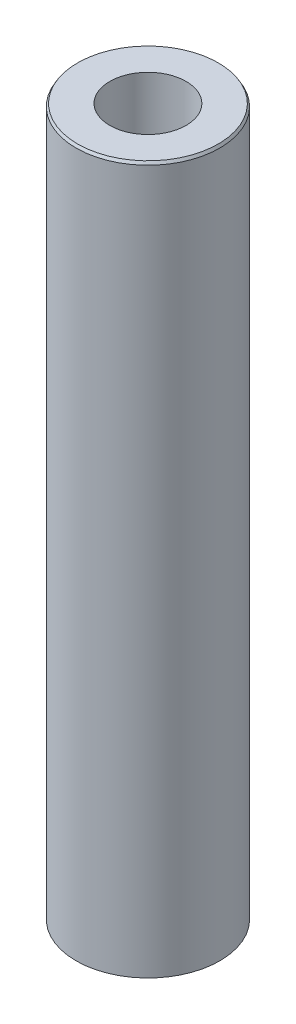
ISO-10303-21;
HEADER;
FILE_DESCRIPTION(('STEP AP214'),'2;1');
FILE_NAME('part.step','',(''),(''),'','','');
FILE_SCHEMA(('AUTOMOTIVE_DESIGN { 1 0 10303 214 1 1 1 1 }'));
ENDSEC;
DATA;
#1=APPLICATION_CONTEXT('core data for automotive mechanical design processes');
#2=APPLICATION_PROTOCOL_DEFINITION('international standard','automotive_design',2000,#1);
#3=PRODUCT_CONTEXT('',#1,'mechanical');
#4=PRODUCT('Part','Part','',(#3));
#5=PRODUCT_RELATED_PRODUCT_CATEGORY('part','',(#4));
#6=PRODUCT_DEFINITION_FORMATION('','',#4);
#7=PRODUCT_DEFINITION_CONTEXT('part definition',#1,'design');
#8=PRODUCT_DEFINITION('design','',#6,#7);
#9=PRODUCT_DEFINITION_SHAPE('','',#8);
#10=(LENGTH_UNIT() NAMED_UNIT(*) SI_UNIT(.MILLI.,.METRE.));
#11=(NAMED_UNIT(*) PLANE_ANGLE_UNIT() SI_UNIT($,.RADIAN.));
#12=(NAMED_UNIT(*) SI_UNIT($,.STERADIAN.) SOLID_ANGLE_UNIT());
#13=UNCERTAINTY_MEASURE_WITH_UNIT(LENGTH_MEASURE(1.E-05),#10,'distance_accuracy_value','');
#14=(GEOMETRIC_REPRESENTATION_CONTEXT(3) GLOBAL_UNCERTAINTY_ASSIGNED_CONTEXT((#13)) GLOBAL_UNIT_ASSIGNED_CONTEXT((#10,
#11,#12)) REPRESENTATION_CONTEXT('',''));
#15=CARTESIAN_POINT('',(0.,0.,0.));
#16=DIRECTION('',(0.,0.,1.));
#17=DIRECTION('',(1.,0.,0.));
#18=AXIS2_PLACEMENT_3D('',#15,#16,#17);
#19=CARTESIAN_POINT('',(0.,467.889511771719,0.));
#20=DIRECTION('',(0.,-1.,0.));
#21=DIRECTION('',(0.,0.,-1.));
#22=AXIS2_PLACEMENT_3D('',#19,#20,#21);
#23=CYLINDRICAL_SURFACE('',#22,47.5);
#24=CARTESIAN_POINT('',(0.,466.091260623015,0.));
#25=DIRECTION('',(0.,1.,0.));
#26=DIRECTION('',(0.,0.,1.));
#27=AXIS2_PLACEMENT_3D('',#24,#25,#26);
#28=CIRCLE('',#27,47.5);
#29=CARTESIAN_POINT('',(0.,466.091260623015,47.5));
#30=VERTEX_POINT('',#29);
#31=EDGE_CURVE('E50',#30,#30,#28,.F.);
#32=ORIENTED_EDGE('',*,*,#31,.T.);
#33=EDGE_LOOP('',(#32));
#34=FACE_BOUND('',#33,.T.);
#35=CARTESIAN_POINT('',(0.,1.03822078477483,0.));
#36=DIRECTION('',(0.,1.,0.));
#37=DIRECTION('',(0.,0.,1.));
#38=AXIS2_PLACEMENT_3D('',#35,#36,#37);
#39=CIRCLE('',#38,47.5);
#40=CARTESIAN_POINT('',(0.,1.03822078477483,47.5));
#41=VERTEX_POINT('',#40);
#42=EDGE_CURVE('E51',#41,#41,#39,.T.);
#43=ORIENTED_EDGE('',*,*,#42,.T.);
#44=EDGE_LOOP('',(#43));
#45=FACE_BOUND('',#44,.T.);
#46=ADVANCED_FACE('F39',(#34,#45),#23,.T.);
#47=CARTESIAN_POINT('',(0.,467.889511771719,0.));
#48=DIRECTION('',(0.,1.,0.));
#49=DIRECTION('',(0.,0.,1.));
#50=AXIS2_PLACEMENT_3D('',#47,#48,#49);
#51=PLANE('',#50);
#52=CARTESIAN_POINT('',(0.,467.889511771719,0.));
#53=DIRECTION('',(0.,1.,0.));
#54=DIRECTION('',(0.,0.,1.));
#55=AXIS2_PLACEMENT_3D('',#52,#53,#54);
#56=CIRCLE('',#55,46.4617792152253);
#57=CARTESIAN_POINT('',(0.,467.889511771719,46.4617792152253));
#58=VERTEX_POINT('',#57);
#59=EDGE_CURVE('E54',#58,#58,#56,.T.);
#60=ORIENTED_EDGE('',*,*,#59,.T.);
#61=EDGE_LOOP('',(#60));
#62=FACE_BOUND('',#61,.T.);
#63=CARTESIAN_POINT('',(0.,467.889511771719,0.));
#64=DIRECTION('',(0.,1.,0.));
#65=DIRECTION('',(0.,0.,1.));
#66=AXIS2_PLACEMENT_3D('',#63,#64,#65);
#67=CIRCLE('',#66,25.2132302449308);
#68=CARTESIAN_POINT('',(0.,467.889511771719,25.2132302449308));
#69=VERTEX_POINT('',#68);
#70=EDGE_CURVE('E58',#69,#69,#67,.T.);
#71=ORIENTED_EDGE('',*,*,#70,.F.);
#72=EDGE_LOOP('',(#71));
#73=FACE_BOUND('',#72,.T.);
#74=ADVANCED_FACE('F69',(#62,#73),#51,.T.);
#75=CARTESIAN_POINT('',(0.,0.,0.));
#76=DIRECTION('',(0.,1.,0.));
#77=DIRECTION('',(0.,0.,1.));
#78=AXIS2_PLACEMENT_3D('',#75,#76,#77);
#79=PLANE('',#78);
#80=CARTESIAN_POINT('',(0.,0.,0.));
#81=DIRECTION('',(0.,1.,0.));
#82=DIRECTION('',(0.,0.,1.));
#83=AXIS2_PLACEMENT_3D('',#80,#81,#82);
#84=CIRCLE('',#83,45.701748851296);
#85=CARTESIAN_POINT('',(0.,0.,45.701748851296));
#86=VERTEX_POINT('',#85);
#87=EDGE_CURVE('E10',#86,#86,#84,.F.);
#88=ORIENTED_EDGE('',*,*,#87,.T.);
#89=EDGE_LOOP('',(#88));
#90=FACE_BOUND('',#89,.T.);
#91=CARTESIAN_POINT('',(0.,0.,0.));
#92=DIRECTION('',(0.,1.,0.));
#93=DIRECTION('',(0.,0.,1.));
#94=AXIS2_PLACEMENT_3D('',#91,#92,#93);
#95=CIRCLE('',#94,25.2132302449308);
#96=CARTESIAN_POINT('',(0.,0.,25.2132302449308));
#97=VERTEX_POINT('',#96);
#98=EDGE_CURVE('E63',#97,#97,#95,.T.);
#99=ORIENTED_EDGE('',*,*,#98,.T.);
#100=EDGE_LOOP('',(#99));
#101=FACE_BOUND('',#100,.T.);
#102=ADVANCED_FACE('F75',(#90,#101),#79,.F.);
#103=CARTESIAN_POINT('',(0.,467.889511771719,0.));
#104=DIRECTION('',(0.,-1.,0.));
#105=DIRECTION('',(0.,0.,-1.));
#106=AXIS2_PLACEMENT_3D('',#103,#104,#105);
#107=CYLINDRICAL_SURFACE('',#106,25.2132302449308);
#108=ORIENTED_EDGE('',*,*,#70,.T.);
#109=EDGE_LOOP('',(#108));
#110=FACE_BOUND('',#109,.T.);
#111=ORIENTED_EDGE('',*,*,#98,.F.);
#112=EDGE_LOOP('',(#111));
#113=FACE_BOUND('',#112,.T.);
#114=ADVANCED_FACE('F70',(#110,#113),#107,.F.);
#115=CARTESIAN_POINT('',(0.,467.889511771719,0.));
#116=DIRECTION('',(0.,-1.,0.));
#117=DIRECTION('',(0.,0.,-1.));
#118=AXIS2_PLACEMENT_3D('',#115,#116,#117);
#119=CONICAL_SURFACE('',#118,46.4617792152253,0.523598775598299);
#120=ORIENTED_EDGE('',*,*,#31,.F.);
#121=EDGE_LOOP('',(#120));
#122=FACE_BOUND('',#121,.T.);
#123=ORIENTED_EDGE('',*,*,#59,.F.);
#124=EDGE_LOOP('',(#123));
#125=FACE_BOUND('',#124,.T.);
#126=ADVANCED_FACE('F81',(#122,#125),#119,.T.);
#127=CARTESIAN_POINT('',(0.,1.03822078477483,0.));
#128=DIRECTION('',(0.,1.,0.));
#129=DIRECTION('',(0.,0.,1.));
#130=AXIS2_PLACEMENT_3D('',#127,#128,#129);
#131=CONICAL_SURFACE('',#130,47.5,1.0471975511966);
#132=ORIENTED_EDGE('',*,*,#87,.F.);
#133=EDGE_LOOP('',(#132));
#134=FACE_BOUND('',#133,.T.);
#135=ORIENTED_EDGE('',*,*,#42,.F.);
#136=EDGE_LOOP('',(#135));
#137=FACE_BOUND('',#136,.T.);
#138=ADVANCED_FACE('F45',(#134,#137),#131,.T.);
#139=CLOSED_SHELL('',(#46,#74,#102,#114,#126,#138));
#140=MANIFOLD_SOLID_BREP('B2',#139);
#141=ADVANCED_BREP_SHAPE_REPRESENTATION('',(#18,#140),#14);
#142=SHAPE_DEFINITION_REPRESENTATION(#9,#141);
ENDSEC;
END-ISO-10303-21;
